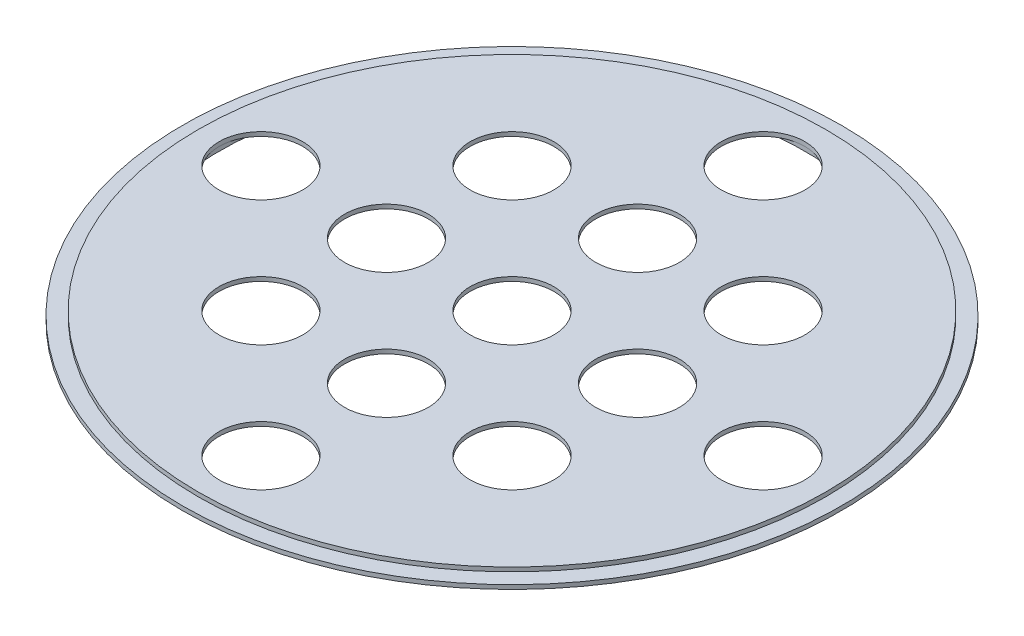
ISO-10303-21;
HEADER;
FILE_DESCRIPTION(('STEP AP214'),'2;1');
FILE_NAME('part.step','',(''),(''),'','','');
FILE_SCHEMA(('AUTOMOTIVE_DESIGN { 1 0 10303 214 1 1 1 1 }'));
ENDSEC;
DATA;
#1=APPLICATION_CONTEXT('core data for automotive mechanical design processes');
#2=APPLICATION_PROTOCOL_DEFINITION('international standard','automotive_design',2000,#1);
#3=PRODUCT_CONTEXT('',#1,'mechanical');
#4=PRODUCT('Part','Part','',(#3));
#5=PRODUCT_RELATED_PRODUCT_CATEGORY('part','',(#4));
#6=PRODUCT_DEFINITION_FORMATION('','',#4);
#7=PRODUCT_DEFINITION_CONTEXT('part definition',#1,'design');
#8=PRODUCT_DEFINITION('design','',#6,#7);
#9=PRODUCT_DEFINITION_SHAPE('','',#8);
#10=(LENGTH_UNIT() NAMED_UNIT(*) SI_UNIT(.MILLI.,.METRE.));
#11=(NAMED_UNIT(*) PLANE_ANGLE_UNIT() SI_UNIT($,.RADIAN.));
#12=(NAMED_UNIT(*) SI_UNIT($,.STERADIAN.) SOLID_ANGLE_UNIT());
#13=UNCERTAINTY_MEASURE_WITH_UNIT(LENGTH_MEASURE(1.E-05),#10,'distance_accuracy_value','');
#14=(GEOMETRIC_REPRESENTATION_CONTEXT(3) GLOBAL_UNCERTAINTY_ASSIGNED_CONTEXT((#13)) GLOBAL_UNIT_ASSIGNED_CONTEXT((#10,
#11,#12)) REPRESENTATION_CONTEXT('',''));
#15=CARTESIAN_POINT('',(0.,0.,0.));
#16=DIRECTION('',(0.,0.,1.));
#17=DIRECTION('',(1.,0.,0.));
#18=AXIS2_PLACEMENT_3D('',#15,#16,#17);
#19=CARTESIAN_POINT('',(0.,0.,0.));
#20=DIRECTION('',(0.,1.,0.));
#21=DIRECTION('',(0.,0.,1.));
#22=AXIS2_PLACEMENT_3D('',#19,#20,#21);
#23=PLANE('',#22);
#24=CARTESIAN_POINT('',(0.,0.,0.));
#25=DIRECTION('',(0.,1.,0.));
#26=DIRECTION('',(0.,0.,1.));
#27=AXIS2_PLACEMENT_3D('',#24,#25,#26);
#28=CIRCLE('',#27,1.);
#29=CARTESIAN_POINT('',(0.,0.,1.));
#30=VERTEX_POINT('',#29);
#31=EDGE_CURVE('E112',#30,#30,#28,.T.);
#32=ORIENTED_EDGE('',*,*,#31,.T.);
#33=EDGE_LOOP('',(#32));
#34=FACE_BOUND('',#33,.T.);
#35=CARTESIAN_POINT('',(3.00000000000001,0.,2.99999999999999));
#36=DIRECTION('',(0.,1.,0.));
#37=DIRECTION('',(0.,0.,1.));
#38=AXIS2_PLACEMENT_3D('',#35,#36,#37);
#39=CIRCLE('',#38,1.);
#40=CARTESIAN_POINT('',(3.00000000000001,0.,3.99999999999999));
#41=VERTEX_POINT('',#40);
#42=EDGE_CURVE('E80',#41,#41,#39,.T.);
#43=ORIENTED_EDGE('',*,*,#42,.T.);
#44=EDGE_LOOP('',(#43));
#45=FACE_BOUND('',#44,.T.);
#46=CARTESIAN_POINT('',(0.,0.,3.));
#47=DIRECTION('',(0.,1.,0.));
#48=DIRECTION('',(0.,0.,1.));
#49=AXIS2_PLACEMENT_3D('',#46,#47,#48);
#50=CIRCLE('',#49,1.);
#51=CARTESIAN_POINT('',(0.,0.,4.));
#52=VERTEX_POINT('',#51);
#53=EDGE_CURVE('E81',#52,#52,#50,.T.);
#54=ORIENTED_EDGE('',*,*,#53,.T.);
#55=EDGE_LOOP('',(#54));
#56=FACE_BOUND('',#55,.T.);
#57=CARTESIAN_POINT('',(-2.99999999999999,0.,3.00000000000001));
#58=DIRECTION('',(0.,1.,0.));
#59=DIRECTION('',(0.,0.,1.));
#60=AXIS2_PLACEMENT_3D('',#57,#58,#59);
#61=CIRCLE('',#60,1.);
#62=CARTESIAN_POINT('',(-2.99999999999999,0.,4.00000000000001));
#63=VERTEX_POINT('',#62);
#64=EDGE_CURVE('E87',#63,#63,#61,.T.);
#65=ORIENTED_EDGE('',*,*,#64,.T.);
#66=EDGE_LOOP('',(#65));
#67=FACE_BOUND('',#66,.T.);
#68=CARTESIAN_POINT('',(-3.,0.,0.));
#69=DIRECTION('',(0.,1.,0.));
#70=DIRECTION('',(0.,0.,1.));
#71=AXIS2_PLACEMENT_3D('',#68,#69,#70);
#72=CIRCLE('',#71,1.);
#73=CARTESIAN_POINT('',(-3.,0.,1.00000000000001));
#74=VERTEX_POINT('',#73);
#75=EDGE_CURVE('E93',#74,#74,#72,.T.);
#76=ORIENTED_EDGE('',*,*,#75,.T.);
#77=EDGE_LOOP('',(#76));
#78=FACE_BOUND('',#77,.T.);
#79=CARTESIAN_POINT('',(-3.00000000000001,0.,-2.99999999999999));
#80=DIRECTION('',(0.,1.,0.));
#81=DIRECTION('',(0.,0.,1.));
#82=AXIS2_PLACEMENT_3D('',#79,#80,#81);
#83=CIRCLE('',#82,1.);
#84=CARTESIAN_POINT('',(-3.00000000000001,0.,-1.99999999999999));
#85=VERTEX_POINT('',#84);
#86=EDGE_CURVE('E99',#85,#85,#83,.T.);
#87=ORIENTED_EDGE('',*,*,#86,.T.);
#88=EDGE_LOOP('',(#87));
#89=FACE_BOUND('',#88,.T.);
#90=CARTESIAN_POINT('',(0.,0.,-3.));
#91=DIRECTION('',(0.,1.,0.));
#92=DIRECTION('',(0.,0.,1.));
#93=AXIS2_PLACEMENT_3D('',#90,#91,#92);
#94=CIRCLE('',#93,1.);
#95=CARTESIAN_POINT('',(0.,0.,-2.));
#96=VERTEX_POINT('',#95);
#97=EDGE_CURVE('E105',#96,#96,#94,.T.);
#98=ORIENTED_EDGE('',*,*,#97,.T.);
#99=EDGE_LOOP('',(#98));
#100=FACE_BOUND('',#99,.T.);
#101=CARTESIAN_POINT('',(3.,0.,0.));
#102=DIRECTION('',(0.,1.,0.));
#103=DIRECTION('',(0.,0.,1.));
#104=AXIS2_PLACEMENT_3D('',#101,#102,#103);
#105=CIRCLE('',#104,1.);
#106=CARTESIAN_POINT('',(3.,0.,0.999999999999994));
#107=VERTEX_POINT('',#106);
#108=EDGE_CURVE('E70',#107,#107,#105,.T.);
#109=ORIENTED_EDGE('',*,*,#108,.T.);
#110=EDGE_LOOP('',(#109));
#111=FACE_BOUND('',#110,.T.);
#112=CARTESIAN_POINT('',(2.99999999999999,0.,-3.00000000000001));
#113=DIRECTION('',(0.,1.,0.));
#114=DIRECTION('',(0.,0.,1.));
#115=AXIS2_PLACEMENT_3D('',#112,#113,#114);
#116=CIRCLE('',#115,1.);
#117=CARTESIAN_POINT('',(2.99999999999999,0.,-2.00000000000001));
#118=VERTEX_POINT('',#117);
#119=EDGE_CURVE('E154',#118,#118,#116,.T.);
#120=ORIENTED_EDGE('',*,*,#119,.T.);
#121=EDGE_LOOP('',(#120));
#122=FACE_BOUND('',#121,.T.);
#123=CARTESIAN_POINT('',(0.,0.,0.));
#124=DIRECTION('',(0.,1.,0.));
#125=DIRECTION('',(0.,0.,1.));
#126=AXIS2_PLACEMENT_3D('',#123,#124,#125);
#127=CIRCLE('',#126,7.);
#128=CARTESIAN_POINT('',(0.,0.,7.));
#129=VERTEX_POINT('',#128);
#130=CARTESIAN_POINT('',(7.,0.,0.));
#131=VERTEX_POINT('',#130);
#132=EDGE_CURVE('E46',#129,#131,#127,.T.);
#133=ORIENTED_EDGE('',*,*,#132,.F.);
#134=CARTESIAN_POINT('',(0.,0.,6.));
#135=DIRECTION('',(0.,1.,0.));
#136=DIRECTION('',(0.,0.,1.));
#137=AXIS2_PLACEMENT_3D('',#134,#135,#136);
#138=CIRCLE('',#137,1.);
#139=EDGE_CURVE('E63',#129,#129,#138,.T.);
#140=ORIENTED_EDGE('',*,*,#139,.T.);
#141=CARTESIAN_POINT('',(-7.,0.,0.));
#142=VERTEX_POINT('',#141);
#143=EDGE_CURVE('E121',#142,#129,#127,.T.);
#144=ORIENTED_EDGE('',*,*,#143,.F.);
#145=CARTESIAN_POINT('',(-6.,0.,0.));
#146=DIRECTION('',(0.,1.,0.));
#147=DIRECTION('',(0.,0.,1.));
#148=AXIS2_PLACEMENT_3D('',#145,#146,#147);
#149=CIRCLE('',#148,1.);
#150=EDGE_CURVE('E73',#142,#142,#149,.T.);
#151=ORIENTED_EDGE('',*,*,#150,.T.);
#152=CARTESIAN_POINT('',(0.,0.,-7.));
#153=VERTEX_POINT('',#152);
#154=EDGE_CURVE('E44',#153,#142,#127,.T.);
#155=ORIENTED_EDGE('',*,*,#154,.F.);
#156=CARTESIAN_POINT('',(0.,0.,-6.));
#157=DIRECTION('',(0.,1.,0.));
#158=DIRECTION('',(0.,0.,1.));
#159=AXIS2_PLACEMENT_3D('',#156,#157,#158);
#160=CIRCLE('',#159,1.);
#161=EDGE_CURVE('E145',#153,#153,#160,.T.);
#162=ORIENTED_EDGE('',*,*,#161,.T.);
#163=EDGE_CURVE('E12',#131,#153,#127,.T.);
#164=ORIENTED_EDGE('',*,*,#163,.F.);
#165=CARTESIAN_POINT('',(6.,0.,0.));
#166=DIRECTION('',(0.,1.,0.));
#167=DIRECTION('',(0.,0.,1.));
#168=AXIS2_PLACEMENT_3D('',#165,#166,#167);
#169=CIRCLE('',#168,1.);
#170=EDGE_CURVE('E150',#131,#131,#169,.T.);
#171=ORIENTED_EDGE('',*,*,#170,.T.);
#172=EDGE_LOOP('',(#133,#140,#144,#151,#155,#162,#164,#171));
#173=FACE_BOUND('',#172,.T.);
#174=ADVANCED_FACE('F35',(#34,#45,#56,#67,#78,#89,#100,#111,#122,#173),#23,.F.);
#175=CARTESIAN_POINT('',(0.,0.1,0.));
#176=DIRECTION('',(0.,-1.,0.));
#177=DIRECTION('',(0.,0.,-1.));
#178=AXIS2_PLACEMENT_3D('',#175,#176,#177);
#179=CYLINDRICAL_SURFACE('',#178,7.5);
#180=CARTESIAN_POINT('',(0.,0.1,0.));
#181=DIRECTION('',(0.,1.,0.));
#182=DIRECTION('',(0.,0.,1.));
#183=AXIS2_PLACEMENT_3D('',#180,#181,#182);
#184=CIRCLE('',#183,7.5);
#185=CARTESIAN_POINT('',(0.,0.1,7.5));
#186=VERTEX_POINT('',#185);
#187=EDGE_CURVE('E118',#186,#186,#184,.T.);
#188=ORIENTED_EDGE('',*,*,#187,.F.);
#189=EDGE_LOOP('',(#188));
#190=FACE_BOUND('',#189,.T.);
#191=CARTESIAN_POINT('',(0.,0.,0.));
#192=DIRECTION('',(0.,1.,0.));
#193=DIRECTION('',(0.,0.,1.));
#194=AXIS2_PLACEMENT_3D('',#191,#192,#193);
#195=CIRCLE('',#194,7.5);
#196=CARTESIAN_POINT('',(0.,0.,7.5));
#197=VERTEX_POINT('',#196);
#198=EDGE_CURVE('E39',#197,#197,#195,.T.);
#199=ORIENTED_EDGE('',*,*,#198,.T.);
#200=EDGE_LOOP('',(#199));
#201=FACE_BOUND('',#200,.T.);
#202=ADVANCED_FACE('F37',(#190,#201),#179,.T.);
#203=CARTESIAN_POINT('',(0.,0.1,0.));
#204=DIRECTION('',(0.,1.,0.));
#205=DIRECTION('',(0.,0.,1.));
#206=AXIS2_PLACEMENT_3D('',#203,#204,#205);
#207=PLANE('',#206);
#208=CARTESIAN_POINT('',(2.99999999999999,0.1,-3.00000000000001));
#209=DIRECTION('',(0.,1.,0.));
#210=DIRECTION('',(0.,0.,1.));
#211=AXIS2_PLACEMENT_3D('',#208,#209,#210);
#212=CIRCLE('',#211,1.);
#213=CARTESIAN_POINT('',(2.99999999999999,0.1,-2.00000000000001));
#214=VERTEX_POINT('',#213);
#215=EDGE_CURVE('E108',#214,#214,#212,.T.);
#216=ORIENTED_EDGE('',*,*,#215,.F.);
#217=EDGE_LOOP('',(#216));
#218=FACE_BOUND('',#217,.T.);
#219=CARTESIAN_POINT('',(3.,0.1,0.));
#220=DIRECTION('',(0.,1.,0.));
#221=DIRECTION('',(0.,0.,1.));
#222=AXIS2_PLACEMENT_3D('',#219,#220,#221);
#223=CIRCLE('',#222,1.);
#224=CARTESIAN_POINT('',(3.,0.1,0.999999999999994));
#225=VERTEX_POINT('',#224);
#226=EDGE_CURVE('E157',#225,#225,#223,.T.);
#227=ORIENTED_EDGE('',*,*,#226,.F.);
#228=EDGE_LOOP('',(#227));
#229=FACE_BOUND('',#228,.T.);
#230=CARTESIAN_POINT('',(0.,0.1,6.));
#231=DIRECTION('',(0.,1.,0.));
#232=DIRECTION('',(0.,0.,1.));
#233=AXIS2_PLACEMENT_3D('',#230,#231,#232);
#234=CIRCLE('',#233,1.);
#235=CARTESIAN_POINT('',(0.,0.1,7.));
#236=VERTEX_POINT('',#235);
#237=EDGE_CURVE('E66',#236,#236,#234,.T.);
#238=ORIENTED_EDGE('',*,*,#237,.F.);
#239=EDGE_LOOP('',(#238));
#240=FACE_BOUND('',#239,.T.);
#241=CARTESIAN_POINT('',(-6.,0.1,0.));
#242=DIRECTION('',(0.,1.,0.));
#243=DIRECTION('',(0.,0.,1.));
#244=AXIS2_PLACEMENT_3D('',#241,#242,#243);
#245=CIRCLE('',#244,1.);
#246=CARTESIAN_POINT('',(-6.,0.1,1.00000000000001));
#247=VERTEX_POINT('',#246);
#248=EDGE_CURVE('E67',#247,#247,#245,.T.);
#249=ORIENTED_EDGE('',*,*,#248,.F.);
#250=EDGE_LOOP('',(#249));
#251=FACE_BOUND('',#250,.T.);
#252=CARTESIAN_POINT('',(0.,0.1,-6.));
#253=DIRECTION('',(0.,1.,0.));
#254=DIRECTION('',(0.,0.,1.));
#255=AXIS2_PLACEMENT_3D('',#252,#253,#254);
#256=CIRCLE('',#255,1.);
#257=CARTESIAN_POINT('',(0.,0.1,-5.));
#258=VERTEX_POINT('',#257);
#259=EDGE_CURVE('E142',#258,#258,#256,.T.);
#260=ORIENTED_EDGE('',*,*,#259,.F.);
#261=EDGE_LOOP('',(#260));
#262=FACE_BOUND('',#261,.T.);
#263=CARTESIAN_POINT('',(6.,0.1,0.));
#264=DIRECTION('',(0.,1.,0.));
#265=DIRECTION('',(0.,0.,1.));
#266=AXIS2_PLACEMENT_3D('',#263,#264,#265);
#267=CIRCLE('',#266,1.);
#268=CARTESIAN_POINT('',(6.,0.1,0.999999999999989));
#269=VERTEX_POINT('',#268);
#270=EDGE_CURVE('E147',#269,#269,#267,.T.);
#271=ORIENTED_EDGE('',*,*,#270,.F.);
#272=EDGE_LOOP('',(#271));
#273=FACE_BOUND('',#272,.T.);
#274=CARTESIAN_POINT('',(0.,0.1,-3.));
#275=DIRECTION('',(0.,1.,0.));
#276=DIRECTION('',(0.,0.,1.));
#277=AXIS2_PLACEMENT_3D('',#274,#275,#276);
#278=CIRCLE('',#277,1.);
#279=CARTESIAN_POINT('',(0.,0.1,-2.));
#280=VERTEX_POINT('',#279);
#281=EDGE_CURVE('E102',#280,#280,#278,.T.);
#282=ORIENTED_EDGE('',*,*,#281,.F.);
#283=EDGE_LOOP('',(#282));
#284=FACE_BOUND('',#283,.T.);
#285=CARTESIAN_POINT('',(-3.00000000000001,0.1,-2.99999999999999));
#286=DIRECTION('',(0.,1.,0.));
#287=DIRECTION('',(0.,0.,1.));
#288=AXIS2_PLACEMENT_3D('',#285,#286,#287);
#289=CIRCLE('',#288,1.);
#290=CARTESIAN_POINT('',(-3.00000000000001,0.1,-1.99999999999999));
#291=VERTEX_POINT('',#290);
#292=EDGE_CURVE('E96',#291,#291,#289,.T.);
#293=ORIENTED_EDGE('',*,*,#292,.F.);
#294=EDGE_LOOP('',(#293));
#295=FACE_BOUND('',#294,.T.);
#296=CARTESIAN_POINT('',(-3.,0.1,0.));
#297=DIRECTION('',(0.,1.,0.));
#298=DIRECTION('',(0.,0.,1.));
#299=AXIS2_PLACEMENT_3D('',#296,#297,#298);
#300=CIRCLE('',#299,1.);
#301=CARTESIAN_POINT('',(-3.,0.1,1.00000000000001));
#302=VERTEX_POINT('',#301);
#303=EDGE_CURVE('E90',#302,#302,#300,.T.);
#304=ORIENTED_EDGE('',*,*,#303,.F.);
#305=EDGE_LOOP('',(#304));
#306=FACE_BOUND('',#305,.T.);
#307=CARTESIAN_POINT('',(-2.99999999999999,0.1,3.00000000000001));
#308=DIRECTION('',(0.,1.,0.));
#309=DIRECTION('',(0.,0.,1.));
#310=AXIS2_PLACEMENT_3D('',#307,#308,#309);
#311=CIRCLE('',#310,1.);
#312=CARTESIAN_POINT('',(-2.99999999999999,0.1,4.00000000000001));
#313=VERTEX_POINT('',#312);
#314=EDGE_CURVE('E84',#313,#313,#311,.T.);
#315=ORIENTED_EDGE('',*,*,#314,.F.);
#316=EDGE_LOOP('',(#315));
#317=FACE_BOUND('',#316,.T.);
#318=CARTESIAN_POINT('',(0.,0.1,3.));
#319=DIRECTION('',(0.,1.,0.));
#320=DIRECTION('',(0.,0.,1.));
#321=AXIS2_PLACEMENT_3D('',#318,#319,#320);
#322=CIRCLE('',#321,1.);
#323=CARTESIAN_POINT('',(0.,0.1,4.));
#324=VERTEX_POINT('',#323);
#325=EDGE_CURVE('E77',#324,#324,#322,.T.);
#326=ORIENTED_EDGE('',*,*,#325,.F.);
#327=EDGE_LOOP('',(#326));
#328=FACE_BOUND('',#327,.T.);
#329=CARTESIAN_POINT('',(3.00000000000001,0.1,2.99999999999999));
#330=DIRECTION('',(0.,1.,0.));
#331=DIRECTION('',(0.,0.,1.));
#332=AXIS2_PLACEMENT_3D('',#329,#330,#331);
#333=CIRCLE('',#332,1.);
#334=CARTESIAN_POINT('',(3.00000000000001,0.1,3.99999999999999));
#335=VERTEX_POINT('',#334);
#336=EDGE_CURVE('E109',#335,#335,#333,.T.);
#337=ORIENTED_EDGE('',*,*,#336,.F.);
#338=EDGE_LOOP('',(#337));
#339=FACE_BOUND('',#338,.T.);
#340=CARTESIAN_POINT('',(0.,0.1,0.));
#341=DIRECTION('',(0.,1.,0.));
#342=DIRECTION('',(0.,0.,1.));
#343=AXIS2_PLACEMENT_3D('',#340,#341,#342);
#344=CIRCLE('',#343,1.);
#345=CARTESIAN_POINT('',(0.,0.1,1.));
#346=VERTEX_POINT('',#345);
#347=EDGE_CURVE('E115',#346,#346,#344,.T.);
#348=ORIENTED_EDGE('',*,*,#347,.F.);
#349=EDGE_LOOP('',(#348));
#350=FACE_BOUND('',#349,.T.);
#351=ORIENTED_EDGE('',*,*,#187,.T.);
#352=EDGE_LOOP('',(#351));
#353=FACE_BOUND('',#352,.T.);
#354=ADVANCED_FACE('F184',(#218,#229,#240,#251,#262,#273,#284,#295,#306,#317,#328,#339,#350,
#353),#207,.T.);
#355=CARTESIAN_POINT('',(0.,0.1,0.));
#356=DIRECTION('',(0.,-1.,0.));
#357=DIRECTION('',(0.,0.,-1.));
#358=AXIS2_PLACEMENT_3D('',#355,#356,#357);
#359=CYLINDRICAL_SURFACE('',#358,1.);
#360=ORIENTED_EDGE('',*,*,#347,.T.);
#361=EDGE_LOOP('',(#360));
#362=FACE_BOUND('',#361,.T.);
#363=ORIENTED_EDGE('',*,*,#31,.F.);
#364=EDGE_LOOP('',(#363));
#365=FACE_BOUND('',#364,.T.);
#366=ADVANCED_FACE('F190',(#362,#365),#359,.F.);
#367=CARTESIAN_POINT('',(3.00000000000001,0.1,2.99999999999999));
#368=DIRECTION('',(0.,-1.,0.));
#369=DIRECTION('',(0.,0.,-1.));
#370=AXIS2_PLACEMENT_3D('',#367,#368,#369);
#371=CYLINDRICAL_SURFACE('',#370,1.);
#372=ORIENTED_EDGE('',*,*,#336,.T.);
#373=EDGE_LOOP('',(#372));
#374=FACE_BOUND('',#373,.T.);
#375=ORIENTED_EDGE('',*,*,#42,.F.);
#376=EDGE_LOOP('',(#375));
#377=FACE_BOUND('',#376,.T.);
#378=ADVANCED_FACE('F194',(#374,#377),#371,.F.);
#379=CARTESIAN_POINT('',(0.,0.1,3.));
#380=DIRECTION('',(0.,-1.,0.));
#381=DIRECTION('',(0.,0.,-1.));
#382=AXIS2_PLACEMENT_3D('',#379,#380,#381);
#383=CYLINDRICAL_SURFACE('',#382,1.);
#384=ORIENTED_EDGE('',*,*,#325,.T.);
#385=EDGE_LOOP('',(#384));
#386=FACE_BOUND('',#385,.T.);
#387=ORIENTED_EDGE('',*,*,#53,.F.);
#388=EDGE_LOOP('',(#387));
#389=FACE_BOUND('',#388,.T.);
#390=ADVANCED_FACE('F198',(#386,#389),#383,.F.);
#391=CARTESIAN_POINT('',(-2.99999999999999,0.1,3.00000000000001));
#392=DIRECTION('',(0.,-1.,0.));
#393=DIRECTION('',(0.,0.,-1.));
#394=AXIS2_PLACEMENT_3D('',#391,#392,#393);
#395=CYLINDRICAL_SURFACE('',#394,1.);
#396=ORIENTED_EDGE('',*,*,#314,.T.);
#397=EDGE_LOOP('',(#396));
#398=FACE_BOUND('',#397,.T.);
#399=ORIENTED_EDGE('',*,*,#64,.F.);
#400=EDGE_LOOP('',(#399));
#401=FACE_BOUND('',#400,.T.);
#402=ADVANCED_FACE('F212',(#398,#401),#395,.F.);
#403=CARTESIAN_POINT('',(-3.,0.1,0.));
#404=DIRECTION('',(0.,-1.,0.));
#405=DIRECTION('',(0.,0.,-1.));
#406=AXIS2_PLACEMENT_3D('',#403,#404,#405);
#407=CYLINDRICAL_SURFACE('',#406,1.);
#408=ORIENTED_EDGE('',*,*,#303,.T.);
#409=EDGE_LOOP('',(#408));
#410=FACE_BOUND('',#409,.T.);
#411=ORIENTED_EDGE('',*,*,#75,.F.);
#412=EDGE_LOOP('',(#411));
#413=FACE_BOUND('',#412,.T.);
#414=ADVANCED_FACE('F208',(#410,#413),#407,.F.);
#415=CARTESIAN_POINT('',(-3.00000000000001,0.1,-2.99999999999999));
#416=DIRECTION('',(0.,-1.,0.));
#417=DIRECTION('',(0.,0.,-1.));
#418=AXIS2_PLACEMENT_3D('',#415,#416,#417);
#419=CYLINDRICAL_SURFACE('',#418,1.);
#420=ORIENTED_EDGE('',*,*,#292,.T.);
#421=EDGE_LOOP('',(#420));
#422=FACE_BOUND('',#421,.T.);
#423=ORIENTED_EDGE('',*,*,#86,.F.);
#424=EDGE_LOOP('',(#423));
#425=FACE_BOUND('',#424,.T.);
#426=ADVANCED_FACE('F204',(#422,#425),#419,.F.);
#427=CARTESIAN_POINT('',(0.,0.1,-3.));
#428=DIRECTION('',(0.,-1.,0.));
#429=DIRECTION('',(0.,0.,-1.));
#430=AXIS2_PLACEMENT_3D('',#427,#428,#429);
#431=CYLINDRICAL_SURFACE('',#430,1.);
#432=ORIENTED_EDGE('',*,*,#281,.T.);
#433=EDGE_LOOP('',(#432));
#434=FACE_BOUND('',#433,.T.);
#435=ORIENTED_EDGE('',*,*,#97,.F.);
#436=EDGE_LOOP('',(#435));
#437=FACE_BOUND('',#436,.T.);
#438=ADVANCED_FACE('F200',(#434,#437),#431,.F.);
#439=CARTESIAN_POINT('',(6.,0.1,0.));
#440=DIRECTION('',(0.,-1.,0.));
#441=DIRECTION('',(0.,0.,-1.));
#442=AXIS2_PLACEMENT_3D('',#439,#440,#441);
#443=CYLINDRICAL_SURFACE('',#442,1.);
#444=ORIENTED_EDGE('',*,*,#270,.T.);
#445=EDGE_LOOP('',(#444));
#446=FACE_BOUND('',#445,.T.);
#447=ORIENTED_EDGE('',*,*,#170,.F.);
#448=EDGE_LOOP('',(#447));
#449=FACE_BOUND('',#448,.T.);
#450=ADVANCED_FACE('F203',(#446,#449),#443,.F.);
#451=CARTESIAN_POINT('',(0.,0.1,-6.));
#452=DIRECTION('',(0.,-1.,0.));
#453=DIRECTION('',(0.,0.,-1.));
#454=AXIS2_PLACEMENT_3D('',#451,#452,#453);
#455=CYLINDRICAL_SURFACE('',#454,1.);
#456=ORIENTED_EDGE('',*,*,#259,.T.);
#457=EDGE_LOOP('',(#456));
#458=FACE_BOUND('',#457,.T.);
#459=ORIENTED_EDGE('',*,*,#161,.F.);
#460=EDGE_LOOP('',(#459));
#461=FACE_BOUND('',#460,.T.);
#462=ADVANCED_FACE('F270',(#458,#461),#455,.F.);
#463=CARTESIAN_POINT('',(-6.,0.1,0.));
#464=DIRECTION('',(0.,-1.,0.));
#465=DIRECTION('',(0.,0.,-1.));
#466=AXIS2_PLACEMENT_3D('',#463,#464,#465);
#467=CYLINDRICAL_SURFACE('',#466,1.);
#468=ORIENTED_EDGE('',*,*,#248,.T.);
#469=EDGE_LOOP('',(#468));
#470=FACE_BOUND('',#469,.T.);
#471=ORIENTED_EDGE('',*,*,#150,.F.);
#472=EDGE_LOOP('',(#471));
#473=FACE_BOUND('',#472,.T.);
#474=ADVANCED_FACE('F176',(#470,#473),#467,.F.);
#475=CARTESIAN_POINT('',(0.,0.1,6.));
#476=DIRECTION('',(0.,-1.,0.));
#477=DIRECTION('',(0.,0.,-1.));
#478=AXIS2_PLACEMENT_3D('',#475,#476,#477);
#479=CYLINDRICAL_SURFACE('',#478,1.);
#480=ORIENTED_EDGE('',*,*,#237,.T.);
#481=EDGE_LOOP('',(#480));
#482=FACE_BOUND('',#481,.T.);
#483=ORIENTED_EDGE('',*,*,#139,.F.);
#484=EDGE_LOOP('',(#483));
#485=FACE_BOUND('',#484,.T.);
#486=ADVANCED_FACE('F64',(#482,#485),#479,.F.);
#487=CARTESIAN_POINT('',(3.,0.1,0.));
#488=DIRECTION('',(0.,-1.,0.));
#489=DIRECTION('',(0.,0.,-1.));
#490=AXIS2_PLACEMENT_3D('',#487,#488,#489);
#491=CYLINDRICAL_SURFACE('',#490,1.);
#492=ORIENTED_EDGE('',*,*,#226,.T.);
#493=EDGE_LOOP('',(#492));
#494=FACE_BOUND('',#493,.T.);
#495=ORIENTED_EDGE('',*,*,#108,.F.);
#496=EDGE_LOOP('',(#495));
#497=FACE_BOUND('',#496,.T.);
#498=ADVANCED_FACE('F164',(#494,#497),#491,.F.);
#499=CARTESIAN_POINT('',(2.99999999999999,0.1,-3.00000000000001));
#500=DIRECTION('',(0.,-1.,0.));
#501=DIRECTION('',(0.,0.,-1.));
#502=AXIS2_PLACEMENT_3D('',#499,#500,#501);
#503=CYLINDRICAL_SURFACE('',#502,1.);
#504=ORIENTED_EDGE('',*,*,#215,.T.);
#505=EDGE_LOOP('',(#504));
#506=FACE_BOUND('',#505,.T.);
#507=ORIENTED_EDGE('',*,*,#119,.F.);
#508=EDGE_LOOP('',(#507));
#509=FACE_BOUND('',#508,.T.);
#510=ADVANCED_FACE('F166',(#506,#509),#503,.F.);
#511=CARTESIAN_POINT('',(0.,0.,0.));
#512=DIRECTION('',(0.,1.,0.));
#513=DIRECTION('',(0.,0.,1.));
#514=AXIS2_PLACEMENT_3D('',#511,#512,#513);
#515=PLANE('',#514);
#516=CARTESIAN_POINT('',(0.,0.,0.));
#517=DIRECTION('',(0.,1.,0.));
#518=DIRECTION('',(0.,0.,1.));
#519=AXIS2_PLACEMENT_3D('',#516,#517,#518);
#520=CIRCLE('',#519,7.87475199771764);
#521=CARTESIAN_POINT('',(0.,0.,7.87475199771764));
#522=VERTEX_POINT('',#521);
#523=EDGE_CURVE('E131',#522,#522,#520,.T.);
#524=ORIENTED_EDGE('',*,*,#523,.T.);
#525=EDGE_LOOP('',(#524));
#526=FACE_BOUND('',#525,.T.);
#527=ORIENTED_EDGE('',*,*,#198,.F.);
#528=EDGE_LOOP('',(#527));
#529=FACE_BOUND('',#528,.T.);
#530=ADVANCED_FACE('F173',(#526,#529),#515,.T.);
#531=CARTESIAN_POINT('',(0.,-0.1,0.));
#532=DIRECTION('',(0.,1.,0.));
#533=DIRECTION('',(0.,0.,1.));
#534=AXIS2_PLACEMENT_3D('',#531,#532,#533);
#535=CYLINDRICAL_SURFACE('',#534,7.87475199771764);
#536=CARTESIAN_POINT('',(0.,-0.1,0.));
#537=DIRECTION('',(0.,1.,0.));
#538=DIRECTION('',(0.,0.,1.));
#539=AXIS2_PLACEMENT_3D('',#536,#537,#538);
#540=CIRCLE('',#539,7.87475199771764);
#541=CARTESIAN_POINT('',(0.,-0.1,7.87475199771764));
#542=VERTEX_POINT('',#541);
#543=EDGE_CURVE('E135',#542,#542,#540,.T.);
#544=ORIENTED_EDGE('',*,*,#543,.T.);
#545=EDGE_LOOP('',(#544));
#546=FACE_BOUND('',#545,.T.);
#547=ORIENTED_EDGE('',*,*,#523,.F.);
#548=EDGE_LOOP('',(#547));
#549=FACE_BOUND('',#548,.T.);
#550=ADVANCED_FACE('F300',(#546,#549),#535,.T.);
#551=CARTESIAN_POINT('',(0.,-0.1,0.));
#552=DIRECTION('',(0.,1.,0.));
#553=DIRECTION('',(0.,0.,1.));
#554=AXIS2_PLACEMENT_3D('',#551,#552,#553);
#555=PLANE('',#554);
#556=CARTESIAN_POINT('',(0.,-0.1,0.));
#557=DIRECTION('',(0.,1.,0.));
#558=DIRECTION('',(0.,0.,1.));
#559=AXIS2_PLACEMENT_3D('',#556,#557,#558);
#560=CIRCLE('',#559,7.);
#561=CARTESIAN_POINT('',(0.,-0.1,7.));
#562=VERTEX_POINT('',#561);
#563=EDGE_CURVE('E129',#562,#562,#560,.T.);
#564=ORIENTED_EDGE('',*,*,#563,.T.);
#565=EDGE_LOOP('',(#564));
#566=FACE_BOUND('',#565,.T.);
#567=ORIENTED_EDGE('',*,*,#543,.F.);
#568=EDGE_LOOP('',(#567));
#569=FACE_BOUND('',#568,.T.);
#570=ADVANCED_FACE('F310',(#566,#569),#555,.F.);
#571=CARTESIAN_POINT('',(0.,-0.1,0.));
#572=DIRECTION('',(0.,1.,0.));
#573=DIRECTION('',(0.,0.,1.));
#574=AXIS2_PLACEMENT_3D('',#571,#572,#573);
#575=CYLINDRICAL_SURFACE('',#574,7.);
#576=ORIENTED_EDGE('',*,*,#563,.F.);
#577=EDGE_LOOP('',(#576));
#578=FACE_BOUND('',#577,.T.);
#579=ORIENTED_EDGE('',*,*,#132,.T.);
#580=ORIENTED_EDGE('',*,*,#163,.T.);
#581=ORIENTED_EDGE('',*,*,#154,.T.);
#582=ORIENTED_EDGE('',*,*,#143,.T.);
#583=EDGE_LOOP('',(#579,#580,#581,#582));
#584=FACE_BOUND('',#583,.T.);
#585=ADVANCED_FACE('F320',(#578,#584),#575,.F.);
#586=CLOSED_SHELL('',(#174,#202,#354,#366,#378,#390,#402,#414,#426,#438,#450,#462,#474,#486,
#498,#510,#530,#550,#570,#585));
#587=MANIFOLD_SOLID_BREP('B2',#586);
#588=ADVANCED_BREP_SHAPE_REPRESENTATION('',(#18,#587),#14);
#589=SHAPE_DEFINITION_REPRESENTATION(#9,#588);
ENDSEC;
END-ISO-10303-21;
